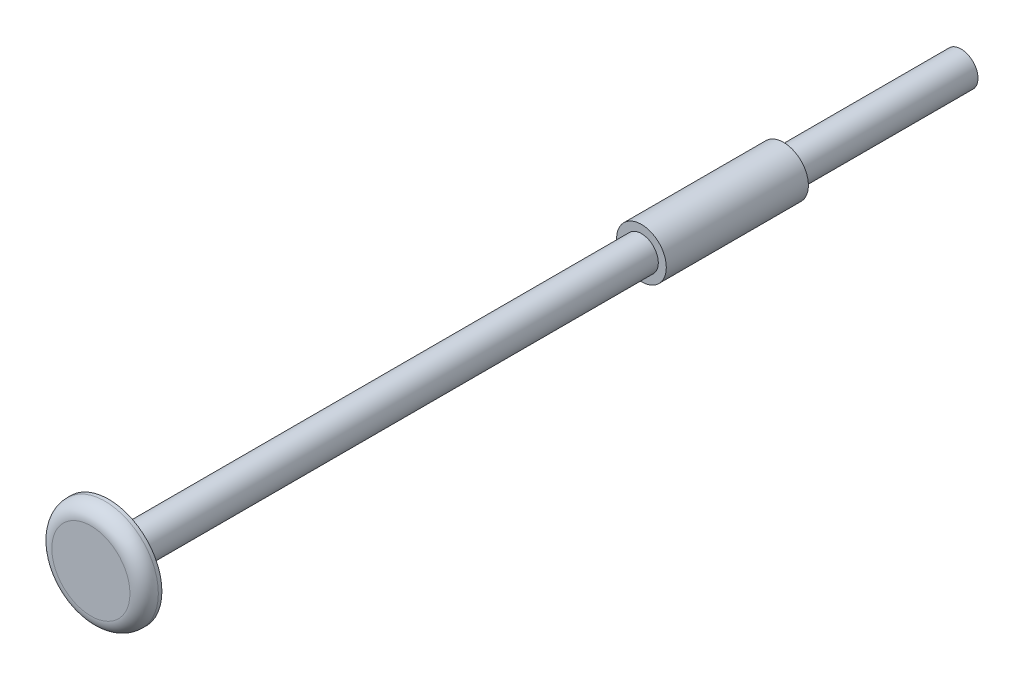
ISO-10303-21;
HEADER;
FILE_DESCRIPTION(('STEP AP214'),'2;1');
FILE_NAME('part.step','',(''),(''),'','','');
FILE_SCHEMA(('AUTOMOTIVE_DESIGN { 1 0 10303 214 1 1 1 1 }'));
ENDSEC;
DATA;
#1=APPLICATION_CONTEXT('core data for automotive mechanical design processes');
#2=APPLICATION_PROTOCOL_DEFINITION('international standard','automotive_design',2000,#1);
#3=PRODUCT_CONTEXT('',#1,'mechanical');
#4=PRODUCT('Part','Part','',(#3));
#5=PRODUCT_RELATED_PRODUCT_CATEGORY('part','',(#4));
#6=PRODUCT_DEFINITION_FORMATION('','',#4);
#7=PRODUCT_DEFINITION_CONTEXT('part definition',#1,'design');
#8=PRODUCT_DEFINITION('design','',#6,#7);
#9=PRODUCT_DEFINITION_SHAPE('','',#8);
#10=(LENGTH_UNIT() NAMED_UNIT(*) SI_UNIT(.MILLI.,.METRE.));
#11=(NAMED_UNIT(*) PLANE_ANGLE_UNIT() SI_UNIT($,.RADIAN.));
#12=(NAMED_UNIT(*) SI_UNIT($,.STERADIAN.) SOLID_ANGLE_UNIT());
#13=UNCERTAINTY_MEASURE_WITH_UNIT(LENGTH_MEASURE(1.E-05),#10,'distance_accuracy_value','');
#14=(GEOMETRIC_REPRESENTATION_CONTEXT(3) GLOBAL_UNCERTAINTY_ASSIGNED_CONTEXT((#13)) GLOBAL_UNIT_ASSIGNED_CONTEXT((#10,
#11,#12)) REPRESENTATION_CONTEXT('',''));
#15=CARTESIAN_POINT('',(0.,0.,0.));
#16=DIRECTION('',(0.,0.,1.));
#17=DIRECTION('',(1.,0.,0.));
#18=AXIS2_PLACEMENT_3D('',#15,#16,#17);
#19=CARTESIAN_POINT('',(0.,0.,2.5));
#20=DIRECTION('',(0.,0.,-1.));
#21=DIRECTION('',(-1.,0.,0.));
#22=AXIS2_PLACEMENT_3D('',#19,#20,#21);
#23=CYLINDRICAL_SURFACE('',#22,7.5);
#24=CARTESIAN_POINT('',(0.,0.,0.5));
#25=DIRECTION('',(0.,0.,1.));
#26=DIRECTION('',(1.,0.,0.));
#27=AXIS2_PLACEMENT_3D('',#24,#25,#26);
#28=CIRCLE('',#27,7.5);
#29=CARTESIAN_POINT('',(7.5,0.,0.5));
#30=VERTEX_POINT('',#29);
#31=EDGE_CURVE('E10',#30,#30,#28,.F.);
#32=ORIENTED_EDGE('',*,*,#31,.T.);
#33=EDGE_LOOP('',(#32));
#34=FACE_BOUND('',#33,.T.);
#35=CARTESIAN_POINT('',(0.,0.,0.));
#36=DIRECTION('',(0.,0.,1.));
#37=DIRECTION('',(1.,0.,0.));
#38=AXIS2_PLACEMENT_3D('',#35,#36,#37);
#39=CIRCLE('',#38,7.5);
#40=CARTESIAN_POINT('',(7.5,0.,0.));
#41=VERTEX_POINT('',#40);
#42=EDGE_CURVE('E46',#41,#41,#39,.T.);
#43=ORIENTED_EDGE('',*,*,#42,.T.);
#44=EDGE_LOOP('',(#43));
#45=FACE_BOUND('',#44,.T.);
#46=ADVANCED_FACE('F31',(#34,#45),#23,.T.);
#47=CARTESIAN_POINT('',(0.,0.,2.5));
#48=DIRECTION('',(0.,0.,1.));
#49=DIRECTION('',(1.,0.,0.));
#50=AXIS2_PLACEMENT_3D('',#47,#48,#49);
#51=PLANE('',#50);
#52=CARTESIAN_POINT('',(0.,0.,2.5));
#53=DIRECTION('',(0.,0.,1.));
#54=DIRECTION('',(1.,0.,0.));
#55=AXIS2_PLACEMENT_3D('',#52,#53,#54);
#56=CIRCLE('',#55,5.5);
#57=CARTESIAN_POINT('',(5.5,0.,2.5));
#58=VERTEX_POINT('',#57);
#59=EDGE_CURVE('E38',#58,#58,#56,.T.);
#60=ORIENTED_EDGE('',*,*,#59,.T.);
#61=EDGE_LOOP('',(#60));
#62=FACE_BOUND('',#61,.T.);
#63=ADVANCED_FACE('F90',(#62),#51,.T.);
#64=CARTESIAN_POINT('',(0.,0.,0.));
#65=DIRECTION('',(0.,0.,1.));
#66=DIRECTION('',(1.,0.,0.));
#67=AXIS2_PLACEMENT_3D('',#64,#65,#66);
#68=PLANE('',#67);
#69=CARTESIAN_POINT('',(0.,0.,0.));
#70=DIRECTION('',(0.,0.,1.));
#71=DIRECTION('',(1.,0.,0.));
#72=AXIS2_PLACEMENT_3D('',#69,#70,#71);
#73=CIRCLE('',#72,2.375);
#74=CARTESIAN_POINT('',(2.375,0.,0.));
#75=VERTEX_POINT('',#74);
#76=EDGE_CURVE('E52',#75,#75,#73,.T.);
#77=ORIENTED_EDGE('',*,*,#76,.T.);
#78=EDGE_LOOP('',(#77));
#79=FACE_BOUND('',#78,.T.);
#80=ORIENTED_EDGE('',*,*,#42,.F.);
#81=EDGE_LOOP('',(#80));
#82=FACE_BOUND('',#81,.T.);
#83=ADVANCED_FACE('F87',(#79,#82),#68,.F.);
#84=CARTESIAN_POINT('',(0.,0.,-120.));
#85=DIRECTION('',(0.,0.,1.));
#86=DIRECTION('',(1.,0.,0.));
#87=AXIS2_PLACEMENT_3D('',#84,#85,#86);
#88=CYLINDRICAL_SURFACE('',#87,2.375);
#89=CARTESIAN_POINT('',(0.,0.,-75.));
#90=DIRECTION('',(0.,0.,1.));
#91=DIRECTION('',(1.,0.,0.));
#92=AXIS2_PLACEMENT_3D('',#89,#90,#91);
#93=CIRCLE('',#92,2.375);
#94=CARTESIAN_POINT('',(2.375,0.,-75.));
#95=VERTEX_POINT('',#94);
#96=EDGE_CURVE('E42',#95,#95,#93,.F.);
#97=ORIENTED_EDGE('',*,*,#96,.F.);
#98=EDGE_LOOP('',(#97));
#99=FACE_BOUND('',#98,.T.);
#100=ORIENTED_EDGE('',*,*,#76,.F.);
#101=EDGE_LOOP('',(#100));
#102=FACE_BOUND('',#101,.T.);
#103=ADVANCED_FACE('F75',(#99,#102),#88,.T.);
#104=CARTESIAN_POINT('',(0.,0.,-95.));
#105=DIRECTION('',(0.,0.,1.));
#106=DIRECTION('',(1.,0.,0.));
#107=AXIS2_PLACEMENT_3D('',#104,#105,#106);
#108=CYLINDRICAL_SURFACE('',#107,3.5);
#109=CARTESIAN_POINT('',(0.,0.,-95.));
#110=DIRECTION('',(0.,0.,1.));
#111=DIRECTION('',(1.,0.,0.));
#112=AXIS2_PLACEMENT_3D('',#109,#110,#111);
#113=CIRCLE('',#112,3.5);
#114=CARTESIAN_POINT('',(3.5,0.,-95.));
#115=VERTEX_POINT('',#114);
#116=EDGE_CURVE('E55',#115,#115,#113,.T.);
#117=ORIENTED_EDGE('',*,*,#116,.T.);
#118=EDGE_LOOP('',(#117));
#119=FACE_BOUND('',#118,.T.);
#120=CARTESIAN_POINT('',(0.,0.,-75.));
#121=DIRECTION('',(0.,0.,1.));
#122=DIRECTION('',(1.,0.,0.));
#123=AXIS2_PLACEMENT_3D('',#120,#121,#122);
#124=CIRCLE('',#123,3.5);
#125=CARTESIAN_POINT('',(3.5,0.,-75.));
#126=VERTEX_POINT('',#125);
#127=EDGE_CURVE('E58',#126,#126,#124,.T.);
#128=ORIENTED_EDGE('',*,*,#127,.F.);
#129=EDGE_LOOP('',(#128));
#130=FACE_BOUND('',#129,.T.);
#131=ADVANCED_FACE('F86',(#119,#130),#108,.T.);
#132=CARTESIAN_POINT('',(0.,0.,-95.));
#133=DIRECTION('',(0.,0.,1.));
#134=DIRECTION('',(1.,0.,0.));
#135=AXIS2_PLACEMENT_3D('',#132,#133,#134);
#136=PLANE('',#135);
#137=CARTESIAN_POINT('',(0.,0.,-95.));
#138=DIRECTION('',(0.,0.,1.));
#139=DIRECTION('',(1.,0.,0.));
#140=AXIS2_PLACEMENT_3D('',#137,#138,#139);
#141=CIRCLE('',#140,2.375);
#142=CARTESIAN_POINT('',(2.375,0.,-95.));
#143=VERTEX_POINT('',#142);
#144=EDGE_CURVE('E61',#143,#143,#141,.T.);
#145=ORIENTED_EDGE('',*,*,#144,.T.);
#146=EDGE_LOOP('',(#145));
#147=FACE_BOUND('',#146,.T.);
#148=ORIENTED_EDGE('',*,*,#116,.F.);
#149=EDGE_LOOP('',(#148));
#150=FACE_BOUND('',#149,.T.);
#151=ADVANCED_FACE('F67',(#147,#150),#136,.F.);
#152=CARTESIAN_POINT('',(0.,0.,-75.));
#153=DIRECTION('',(0.,0.,1.));
#154=DIRECTION('',(1.,0.,0.));
#155=AXIS2_PLACEMENT_3D('',#152,#153,#154);
#156=PLANE('',#155);
#157=ORIENTED_EDGE('',*,*,#96,.T.);
#158=EDGE_LOOP('',(#157));
#159=FACE_BOUND('',#158,.T.);
#160=ORIENTED_EDGE('',*,*,#127,.T.);
#161=EDGE_LOOP('',(#160));
#162=FACE_BOUND('',#161,.T.);
#163=ADVANCED_FACE('F81',(#159,#162),#156,.T.);
#164=CARTESIAN_POINT('',(0.,0.,-120.));
#165=DIRECTION('',(0.,0.,1.));
#166=DIRECTION('',(1.,0.,0.));
#167=AXIS2_PLACEMENT_3D('',#164,#165,#166);
#168=PLANE('',#167);
#169=CARTESIAN_POINT('',(0.,0.,-120.));
#170=DIRECTION('',(0.,0.,1.));
#171=DIRECTION('',(1.,0.,0.));
#172=AXIS2_PLACEMENT_3D('',#169,#170,#171);
#173=CIRCLE('',#172,2.375);
#174=CARTESIAN_POINT('',(2.375,0.,-120.));
#175=VERTEX_POINT('',#174);
#176=EDGE_CURVE('E51',#175,#175,#173,.T.);
#177=ORIENTED_EDGE('',*,*,#176,.F.);
#178=EDGE_LOOP('',(#177));
#179=FACE_BOUND('',#178,.T.);
#180=ADVANCED_FACE('F72',(#179),#168,.F.);
#181=ORIENTED_EDGE('',*,*,#176,.T.);
#182=EDGE_LOOP('',(#181));
#183=FACE_BOUND('',#182,.T.);
#184=ORIENTED_EDGE('',*,*,#144,.F.);
#185=EDGE_LOOP('',(#184));
#186=FACE_BOUND('',#185,.T.);
#187=ADVANCED_FACE('F70',(#183,#186),#88,.T.);
#188=CARTESIAN_POINT('',(0.,0.,0.5));
#189=DIRECTION('',(0.,0.,1.));
#190=DIRECTION('',(1.,0.,0.));
#191=AXIS2_PLACEMENT_3D('',#188,#189,#190);
#192=TOROIDAL_SURFACE('',#191,5.5,2.);
#193=ORIENTED_EDGE('',*,*,#31,.F.);
#194=EDGE_LOOP('',(#193));
#195=FACE_BOUND('',#194,.T.);
#196=ORIENTED_EDGE('',*,*,#59,.F.);
#197=EDGE_LOOP('',(#196));
#198=FACE_BOUND('',#197,.T.);
#199=ADVANCED_FACE('F33',(#195,#198),#192,.T.);
#200=CLOSED_SHELL('',(#46,#63,#83,#103,#131,#151,#163,#180,#187,#199));
#201=MANIFOLD_SOLID_BREP('B2',#200);
#202=ADVANCED_BREP_SHAPE_REPRESENTATION('',(#18,#201),#14);
#203=SHAPE_DEFINITION_REPRESENTATION(#9,#202);
ENDSEC;
END-ISO-10303-21;
